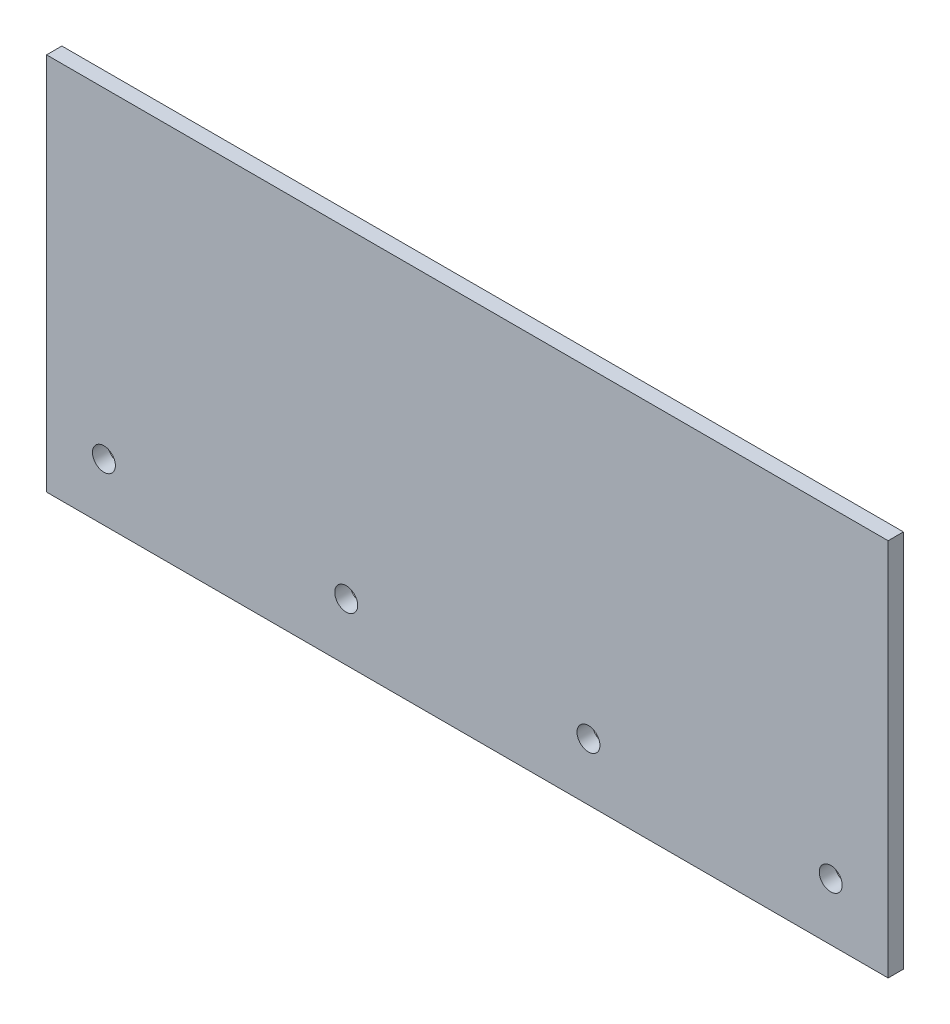
ISO-10303-21;
HEADER;
FILE_DESCRIPTION(('STEP AP214'),'2;1');
FILE_NAME('part.step','',(''),(''),'','','');
FILE_SCHEMA(('AUTOMOTIVE_DESIGN { 1 0 10303 214 1 1 1 1 }'));
ENDSEC;
DATA;
#1=APPLICATION_CONTEXT('core data for automotive mechanical design processes');
#2=APPLICATION_PROTOCOL_DEFINITION('international standard','automotive_design',2000,#1);
#3=PRODUCT_CONTEXT('',#1,'mechanical');
#4=PRODUCT('Part','Part','',(#3));
#5=PRODUCT_RELATED_PRODUCT_CATEGORY('part','',(#4));
#6=PRODUCT_DEFINITION_FORMATION('','',#4);
#7=PRODUCT_DEFINITION_CONTEXT('part definition',#1,'design');
#8=PRODUCT_DEFINITION('design','',#6,#7);
#9=PRODUCT_DEFINITION_SHAPE('','',#8);
#10=(LENGTH_UNIT() NAMED_UNIT(*) SI_UNIT(.MILLI.,.METRE.));
#11=(NAMED_UNIT(*) PLANE_ANGLE_UNIT() SI_UNIT($,.RADIAN.));
#12=(NAMED_UNIT(*) SI_UNIT($,.STERADIAN.) SOLID_ANGLE_UNIT());
#13=UNCERTAINTY_MEASURE_WITH_UNIT(LENGTH_MEASURE(1.E-05),#10,'distance_accuracy_value','');
#14=(GEOMETRIC_REPRESENTATION_CONTEXT(3) GLOBAL_UNCERTAINTY_ASSIGNED_CONTEXT((#13)) GLOBAL_UNIT_ASSIGNED_CONTEXT((#10,
#11,#12)) REPRESENTATION_CONTEXT('',''));
#15=CARTESIAN_POINT('',(0.,0.,0.));
#16=DIRECTION('',(0.,0.,1.));
#17=DIRECTION('',(1.,0.,0.));
#18=AXIS2_PLACEMENT_3D('',#15,#16,#17);
#19=CARTESIAN_POINT('',(0.,0.,4.));
#20=DIRECTION('',(0.,0.,-1.));
#21=DIRECTION('',(-1.,0.,0.));
#22=AXIS2_PLACEMENT_3D('',#19,#20,#21);
#23=PLANE('',#22);
#24=DIRECTION('',(0.,1.,0.));
#25=VECTOR('',#24,1.);
#26=CARTESIAN_POINT('',(220.,0.,4.));
#27=LINE('',#26,#25);
#28=CARTESIAN_POINT('',(220.,0.,4.));
#29=VERTEX_POINT('',#28);
#30=CARTESIAN_POINT('',(220.,99.,4.));
#31=VERTEX_POINT('',#30);
#32=EDGE_CURVE('E85',#29,#31,#27,.T.);
#33=ORIENTED_EDGE('',*,*,#32,.T.);
#34=DIRECTION('',(-1.,0.,0.));
#35=VECTOR('',#34,1.);
#36=CARTESIAN_POINT('',(0.,99.,4.));
#37=LINE('',#36,#35);
#38=CARTESIAN_POINT('',(0.,99.,4.));
#39=VERTEX_POINT('',#38);
#40=EDGE_CURVE('E80',#31,#39,#37,.T.);
#41=ORIENTED_EDGE('',*,*,#40,.T.);
#42=DIRECTION('',(0.,-1.,0.));
#43=VECTOR('',#42,1.);
#44=CARTESIAN_POINT('',(0.,99.,4.));
#45=LINE('',#44,#43);
#46=CARTESIAN_POINT('',(0.,0.,4.));
#47=VERTEX_POINT('',#46);
#48=EDGE_CURVE('E83',#39,#47,#45,.T.);
#49=ORIENTED_EDGE('',*,*,#48,.T.);
#50=DIRECTION('',(1.,0.,0.));
#51=VECTOR('',#50,1.);
#52=CARTESIAN_POINT('',(0.,0.,4.));
#53=LINE('',#52,#51);
#54=EDGE_CURVE('E50',#47,#29,#53,.T.);
#55=ORIENTED_EDGE('',*,*,#54,.T.);
#56=EDGE_LOOP('',(#33,#41,#49,#55));
#57=FACE_BOUND('',#56,.T.);
#58=CARTESIAN_POINT('',(205.,15.,4.));
#59=DIRECTION('',(0.,0.,1.));
#60=DIRECTION('',(1.,0.,0.));
#61=AXIS2_PLACEMENT_3D('',#58,#59,#60);
#62=CIRCLE('',#61,2.99999999999999);
#63=CARTESIAN_POINT('',(208.,15.,4.));
#64=VERTEX_POINT('',#63);
#65=EDGE_CURVE('E100',#64,#64,#62,.T.);
#66=ORIENTED_EDGE('',*,*,#65,.F.);
#67=EDGE_LOOP('',(#66));
#68=FACE_BOUND('',#67,.T.);
#69=CARTESIAN_POINT('',(15.,15.,4.));
#70=DIRECTION('',(0.,0.,1.));
#71=DIRECTION('',(1.,0.,0.));
#72=AXIS2_PLACEMENT_3D('',#69,#70,#71);
#73=CIRCLE('',#72,3.);
#74=CARTESIAN_POINT('',(18.,15.,4.));
#75=VERTEX_POINT('',#74);
#76=EDGE_CURVE('E115',#75,#75,#73,.T.);
#77=ORIENTED_EDGE('',*,*,#76,.F.);
#78=EDGE_LOOP('',(#77));
#79=FACE_BOUND('',#78,.T.);
#80=CARTESIAN_POINT('',(141.666666666667,15.,4.));
#81=DIRECTION('',(0.,0.,1.));
#82=DIRECTION('',(1.,0.,0.));
#83=AXIS2_PLACEMENT_3D('',#80,#81,#82);
#84=CIRCLE('',#83,2.99999999999999);
#85=CARTESIAN_POINT('',(144.666666666667,15.,4.));
#86=VERTEX_POINT('',#85);
#87=EDGE_CURVE('E121',#86,#86,#84,.T.);
#88=ORIENTED_EDGE('',*,*,#87,.F.);
#89=EDGE_LOOP('',(#88));
#90=FACE_BOUND('',#89,.T.);
#91=CARTESIAN_POINT('',(78.3333333333334,15.,4.));
#92=DIRECTION('',(0.,0.,1.));
#93=DIRECTION('',(1.,0.,0.));
#94=AXIS2_PLACEMENT_3D('',#91,#92,#93);
#95=CIRCLE('',#94,3.00000000000001);
#96=CARTESIAN_POINT('',(81.3333333333334,15.,4.));
#97=VERTEX_POINT('',#96);
#98=EDGE_CURVE('E127',#97,#97,#95,.T.);
#99=ORIENTED_EDGE('',*,*,#98,.F.);
#100=EDGE_LOOP('',(#99));
#101=FACE_BOUND('',#100,.T.);
#102=ADVANCED_FACE('F33',(#57,#68,#79,#90,#101),#23,.F.);
#103=CARTESIAN_POINT('',(0.,0.,0.));
#104=DIRECTION('',(0.,0.,-1.));
#105=DIRECTION('',(-1.,0.,0.));
#106=AXIS2_PLACEMENT_3D('',#103,#104,#105);
#107=PLANE('',#106);
#108=CARTESIAN_POINT('',(141.666666666667,15.,0.));
#109=DIRECTION('',(0.,0.,1.));
#110=DIRECTION('',(1.,0.,0.));
#111=AXIS2_PLACEMENT_3D('',#108,#109,#110);
#112=CIRCLE('',#111,2.99999999999999);
#113=CARTESIAN_POINT('',(144.666666666667,15.,0.));
#114=VERTEX_POINT('',#113);
#115=EDGE_CURVE('E124',#114,#114,#112,.T.);
#116=ORIENTED_EDGE('',*,*,#115,.T.);
#117=EDGE_LOOP('',(#116));
#118=FACE_BOUND('',#117,.T.);
#119=CARTESIAN_POINT('',(205.,15.,0.));
#120=DIRECTION('',(0.,0.,1.));
#121=DIRECTION('',(1.,0.,0.));
#122=AXIS2_PLACEMENT_3D('',#119,#120,#121);
#123=CIRCLE('',#122,2.99999999999999);
#124=CARTESIAN_POINT('',(208.,15.,0.));
#125=VERTEX_POINT('',#124);
#126=EDGE_CURVE('E112',#125,#125,#123,.T.);
#127=ORIENTED_EDGE('',*,*,#126,.T.);
#128=EDGE_LOOP('',(#127));
#129=FACE_BOUND('',#128,.T.);
#130=DIRECTION('',(0.,1.,0.));
#131=VECTOR('',#130,1.);
#132=CARTESIAN_POINT('',(220.,0.,0.));
#133=LINE('',#132,#131);
#134=CARTESIAN_POINT('',(220.,0.,0.));
#135=VERTEX_POINT('',#134);
#136=CARTESIAN_POINT('',(220.,99.,0.));
#137=VERTEX_POINT('',#136);
#138=EDGE_CURVE('E97',#135,#137,#133,.T.);
#139=ORIENTED_EDGE('',*,*,#138,.F.);
#140=DIRECTION('',(1.,0.,0.));
#141=VECTOR('',#140,1.);
#142=CARTESIAN_POINT('',(0.,0.,0.));
#143=LINE('',#142,#141);
#144=CARTESIAN_POINT('',(0.,0.,0.));
#145=VERTEX_POINT('',#144);
#146=EDGE_CURVE('E73',#145,#135,#143,.T.);
#147=ORIENTED_EDGE('',*,*,#146,.F.);
#148=DIRECTION('',(0.,-1.,0.));
#149=VECTOR('',#148,1.);
#150=CARTESIAN_POINT('',(0.,99.,0.));
#151=LINE('',#150,#149);
#152=CARTESIAN_POINT('',(0.,99.,0.));
#153=VERTEX_POINT('',#152);
#154=EDGE_CURVE('E67',#153,#145,#151,.T.);
#155=ORIENTED_EDGE('',*,*,#154,.F.);
#156=DIRECTION('',(-1.,0.,0.));
#157=VECTOR('',#156,1.);
#158=CARTESIAN_POINT('',(0.,99.,0.));
#159=LINE('',#158,#157);
#160=EDGE_CURVE('E89',#137,#153,#159,.T.);
#161=ORIENTED_EDGE('',*,*,#160,.F.);
#162=EDGE_LOOP('',(#139,#147,#155,#161));
#163=FACE_BOUND('',#162,.T.);
#164=CARTESIAN_POINT('',(15.,15.,0.));
#165=DIRECTION('',(0.,0.,1.));
#166=DIRECTION('',(1.,0.,0.));
#167=AXIS2_PLACEMENT_3D('',#164,#165,#166);
#168=CIRCLE('',#167,3.);
#169=CARTESIAN_POINT('',(18.,15.,0.));
#170=VERTEX_POINT('',#169);
#171=EDGE_CURVE('E118',#170,#170,#168,.T.);
#172=ORIENTED_EDGE('',*,*,#171,.T.);
#173=EDGE_LOOP('',(#172));
#174=FACE_BOUND('',#173,.T.);
#175=CARTESIAN_POINT('',(78.3333333333334,15.,0.));
#176=DIRECTION('',(0.,0.,1.));
#177=DIRECTION('',(1.,0.,0.));
#178=AXIS2_PLACEMENT_3D('',#175,#176,#177);
#179=CIRCLE('',#178,3.00000000000001);
#180=CARTESIAN_POINT('',(81.3333333333334,15.,0.));
#181=VERTEX_POINT('',#180);
#182=EDGE_CURVE('E130',#181,#181,#179,.T.);
#183=ORIENTED_EDGE('',*,*,#182,.T.);
#184=EDGE_LOOP('',(#183));
#185=FACE_BOUND('',#184,.T.);
#186=ADVANCED_FACE('F108',(#118,#129,#163,#174,#185),#107,.T.);
#187=CARTESIAN_POINT('',(220.,0.,4.));
#188=DIRECTION('',(-1.,0.,0.));
#189=DIRECTION('',(0.,-1.,0.));
#190=AXIS2_PLACEMENT_3D('',#187,#188,#189);
#191=PLANE('',#190);
#192=ORIENTED_EDGE('',*,*,#138,.T.);
#193=DIRECTION('',(0.,0.,-1.));
#194=VECTOR('',#193,1.);
#195=CARTESIAN_POINT('',(220.,99.,4.));
#196=LINE('',#195,#194);
#197=EDGE_CURVE('E11',#31,#137,#196,.T.);
#198=ORIENTED_EDGE('',*,*,#197,.F.);
#199=ORIENTED_EDGE('',*,*,#32,.F.);
#200=DIRECTION('',(0.,0.,-1.));
#201=VECTOR('',#200,1.);
#202=CARTESIAN_POINT('',(220.,0.,4.));
#203=LINE('',#202,#201);
#204=EDGE_CURVE('E93',#29,#135,#203,.T.);
#205=ORIENTED_EDGE('',*,*,#204,.T.);
#206=EDGE_LOOP('',(#192,#198,#199,#205));
#207=FACE_BOUND('',#206,.T.);
#208=ADVANCED_FACE('F35',(#207),#191,.F.);
#209=CARTESIAN_POINT('',(0.,99.,4.));
#210=DIRECTION('',(0.,-1.,0.));
#211=DIRECTION('',(0.,0.,-1.));
#212=AXIS2_PLACEMENT_3D('',#209,#210,#211);
#213=PLANE('',#212);
#214=ORIENTED_EDGE('',*,*,#160,.T.);
#215=DIRECTION('',(0.,0.,-1.));
#216=VECTOR('',#215,1.);
#217=CARTESIAN_POINT('',(0.,99.,4.));
#218=LINE('',#217,#216);
#219=EDGE_CURVE('E42',#39,#153,#218,.T.);
#220=ORIENTED_EDGE('',*,*,#219,.F.);
#221=ORIENTED_EDGE('',*,*,#40,.F.);
#222=ORIENTED_EDGE('',*,*,#197,.T.);
#223=EDGE_LOOP('',(#214,#220,#221,#222));
#224=FACE_BOUND('',#223,.T.);
#225=ADVANCED_FACE('F88',(#224),#213,.F.);
#226=CARTESIAN_POINT('',(0.,99.,4.));
#227=DIRECTION('',(1.,0.,0.));
#228=DIRECTION('',(0.,1.,0.));
#229=AXIS2_PLACEMENT_3D('',#226,#227,#228);
#230=PLANE('',#229);
#231=ORIENTED_EDGE('',*,*,#154,.T.);
#232=DIRECTION('',(0.,0.,-1.));
#233=VECTOR('',#232,1.);
#234=CARTESIAN_POINT('',(0.,0.,4.));
#235=LINE('',#234,#233);
#236=EDGE_CURVE('E90',#47,#145,#235,.T.);
#237=ORIENTED_EDGE('',*,*,#236,.F.);
#238=ORIENTED_EDGE('',*,*,#48,.F.);
#239=ORIENTED_EDGE('',*,*,#219,.T.);
#240=EDGE_LOOP('',(#231,#237,#238,#239));
#241=FACE_BOUND('',#240,.T.);
#242=ADVANCED_FACE('F91',(#241),#230,.F.);
#243=CARTESIAN_POINT('',(0.,0.,4.));
#244=DIRECTION('',(0.,1.,0.));
#245=DIRECTION('',(-1.,0.,0.));
#246=AXIS2_PLACEMENT_3D('',#243,#244,#245);
#247=PLANE('',#246);
#248=ORIENTED_EDGE('',*,*,#146,.T.);
#249=ORIENTED_EDGE('',*,*,#204,.F.);
#250=ORIENTED_EDGE('',*,*,#54,.F.);
#251=ORIENTED_EDGE('',*,*,#236,.T.);
#252=EDGE_LOOP('',(#248,#249,#250,#251));
#253=FACE_BOUND('',#252,.T.);
#254=ADVANCED_FACE('F105',(#253),#247,.F.);
#255=CARTESIAN_POINT('',(205.,15.,4.));
#256=DIRECTION('',(0.,0.,-1.));
#257=DIRECTION('',(-1.,0.,0.));
#258=AXIS2_PLACEMENT_3D('',#255,#256,#257);
#259=CYLINDRICAL_SURFACE('',#258,2.99999999999999);
#260=ORIENTED_EDGE('',*,*,#65,.T.);
#261=EDGE_LOOP('',(#260));
#262=FACE_BOUND('',#261,.T.);
#263=ORIENTED_EDGE('',*,*,#126,.F.);
#264=EDGE_LOOP('',(#263));
#265=FACE_BOUND('',#264,.T.);
#266=ADVANCED_FACE('F147',(#262,#265),#259,.F.);
#267=CARTESIAN_POINT('',(15.,15.,4.));
#268=DIRECTION('',(0.,0.,-1.));
#269=DIRECTION('',(-1.,0.,0.));
#270=AXIS2_PLACEMENT_3D('',#267,#268,#269);
#271=CYLINDRICAL_SURFACE('',#270,3.);
#272=ORIENTED_EDGE('',*,*,#76,.T.);
#273=EDGE_LOOP('',(#272));
#274=FACE_BOUND('',#273,.T.);
#275=ORIENTED_EDGE('',*,*,#171,.F.);
#276=EDGE_LOOP('',(#275));
#277=FACE_BOUND('',#276,.T.);
#278=ADVANCED_FACE('F193',(#274,#277),#271,.F.);
#279=CARTESIAN_POINT('',(141.666666666667,15.,4.));
#280=DIRECTION('',(0.,0.,-1.));
#281=DIRECTION('',(-1.,0.,0.));
#282=AXIS2_PLACEMENT_3D('',#279,#280,#281);
#283=CYLINDRICAL_SURFACE('',#282,2.99999999999999);
#284=ORIENTED_EDGE('',*,*,#87,.T.);
#285=EDGE_LOOP('',(#284));
#286=FACE_BOUND('',#285,.T.);
#287=ORIENTED_EDGE('',*,*,#115,.F.);
#288=EDGE_LOOP('',(#287));
#289=FACE_BOUND('',#288,.T.);
#290=ADVANCED_FACE('F201',(#286,#289),#283,.F.);
#291=CARTESIAN_POINT('',(78.3333333333334,15.,4.));
#292=DIRECTION('',(0.,0.,-1.));
#293=DIRECTION('',(-1.,0.,0.));
#294=AXIS2_PLACEMENT_3D('',#291,#292,#293);
#295=CYLINDRICAL_SURFACE('',#294,3.00000000000001);
#296=ORIENTED_EDGE('',*,*,#98,.T.);
#297=EDGE_LOOP('',(#296));
#298=FACE_BOUND('',#297,.T.);
#299=ORIENTED_EDGE('',*,*,#182,.F.);
#300=EDGE_LOOP('',(#299));
#301=FACE_BOUND('',#300,.T.);
#302=ADVANCED_FACE('F136',(#298,#301),#295,.F.);
#303=CLOSED_SHELL('',(#102,#186,#208,#225,#242,#254,#266,#278,#290,#302));
#304=MANIFOLD_SOLID_BREP('B2',#303);
#305=ADVANCED_BREP_SHAPE_REPRESENTATION('',(#18,#304),#14);
#306=SHAPE_DEFINITION_REPRESENTATION(#9,#305);
ENDSEC;
END-ISO-10303-21;
